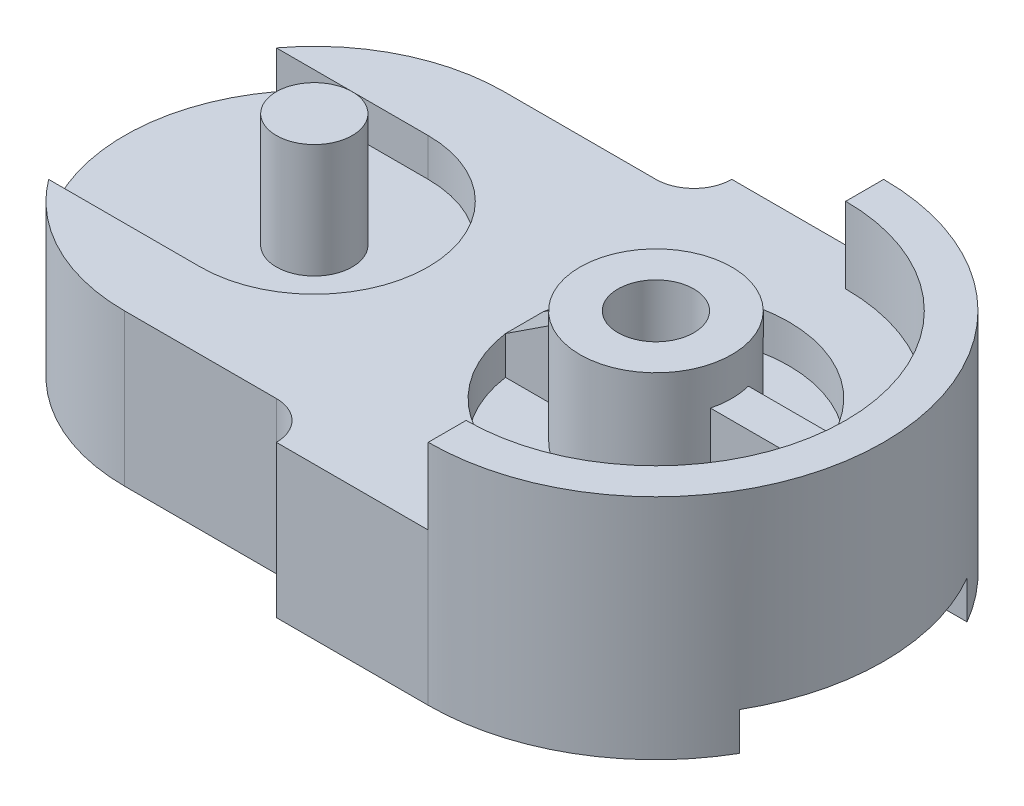
ISO-10303-21;
HEADER;
FILE_DESCRIPTION(('STEP AP214'),'2;1');
FILE_NAME('part.step','',(''),(''),'','','');
FILE_SCHEMA(('AUTOMOTIVE_DESIGN { 1 0 10303 214 1 1 1 1 }'));
ENDSEC;
DATA;
#1=APPLICATION_CONTEXT('core data for automotive mechanical design processes');
#2=APPLICATION_PROTOCOL_DEFINITION('international standard','automotive_design',2000,#1);
#3=PRODUCT_CONTEXT('',#1,'mechanical');
#4=PRODUCT('Part','Part','',(#3));
#5=PRODUCT_RELATED_PRODUCT_CATEGORY('part','',(#4));
#6=PRODUCT_DEFINITION_FORMATION('','',#4);
#7=PRODUCT_DEFINITION_CONTEXT('part definition',#1,'design');
#8=PRODUCT_DEFINITION('design','',#6,#7);
#9=PRODUCT_DEFINITION_SHAPE('','',#8);
#10=(LENGTH_UNIT() NAMED_UNIT(*) SI_UNIT(.MILLI.,.METRE.));
#11=(NAMED_UNIT(*) PLANE_ANGLE_UNIT() SI_UNIT($,.RADIAN.));
#12=(NAMED_UNIT(*) SI_UNIT($,.STERADIAN.) SOLID_ANGLE_UNIT());
#13=UNCERTAINTY_MEASURE_WITH_UNIT(LENGTH_MEASURE(1.E-05),#10,'distance_accuracy_value','');
#14=(GEOMETRIC_REPRESENTATION_CONTEXT(3) GLOBAL_UNCERTAINTY_ASSIGNED_CONTEXT((#13)) GLOBAL_UNIT_ASSIGNED_CONTEXT((#10,
#11,#12)) REPRESENTATION_CONTEXT('',''));
#15=CARTESIAN_POINT('',(0.,0.,0.));
#16=DIRECTION('',(0.,0.,1.));
#17=DIRECTION('',(1.,0.,0.));
#18=AXIS2_PLACEMENT_3D('',#15,#16,#17);
#19=CARTESIAN_POINT('',(140.,60.,-60.));
#20=DIRECTION('',(0.,-1.,0.));
#21=DIRECTION('',(0.,0.,-1.));
#22=AXIS2_PLACEMENT_3D('',#19,#20,#21);
#23=CYLINDRICAL_SURFACE('',#22,20.);
#24=CARTESIAN_POINT('',(140.,60.,-60.));
#25=DIRECTION('',(0.,1.,0.));
#26=DIRECTION('',(0.,0.,1.));
#27=AXIS2_PLACEMENT_3D('',#24,#25,#26);
#28=CIRCLE('',#27,20.);
#29=CARTESIAN_POINT('',(140.,60.,-40.));
#30=VERTEX_POINT('',#29);
#31=EDGE_CURVE('E304',#30,#30,#28,.T.);
#32=ORIENTED_EDGE('',*,*,#31,.F.);
#33=EDGE_LOOP('',(#32));
#34=FACE_BOUND('',#33,.T.);
#35=DIRECTION('',(0.,-1.,0.));
#36=VECTOR('',#35,1.);
#37=CARTESIAN_POINT('',(120.635083268963,50.,-65.));
#38=LINE('',#37,#36);
#39=CARTESIAN_POINT('',(120.635083268963,50.,-65.));
#40=VERTEX_POINT('',#39);
#41=CARTESIAN_POINT('',(120.635083268963,30.,-65.));
#42=VERTEX_POINT('',#41);
#43=EDGE_CURVE('E260',#40,#42,#38,.T.);
#44=ORIENTED_EDGE('',*,*,#43,.F.);
#45=CARTESIAN_POINT('',(140.,50.,-60.));
#46=DIRECTION('',(0.,1.,0.));
#47=DIRECTION('',(0.,0.,1.));
#48=AXIS2_PLACEMENT_3D('',#45,#46,#47);
#49=CIRCLE('',#48,20.);
#50=CARTESIAN_POINT('',(120.635083268963,50.,-55.));
#51=VERTEX_POINT('',#50);
#52=EDGE_CURVE('E11',#40,#51,#49,.T.);
#53=ORIENTED_EDGE('',*,*,#52,.T.);
#54=DIRECTION('',(0.,-1.,0.));
#55=VECTOR('',#54,1.);
#56=CARTESIAN_POINT('',(120.635083268963,50.,-55.));
#57=LINE('',#56,#55);
#58=CARTESIAN_POINT('',(120.635083268963,30.,-55.));
#59=VERTEX_POINT('',#58);
#60=EDGE_CURVE('E266',#51,#59,#57,.T.);
#61=ORIENTED_EDGE('',*,*,#60,.T.);
#62=CARTESIAN_POINT('',(140.,30.,-60.));
#63=DIRECTION('',(0.,1.,0.));
#64=DIRECTION('',(0.,0.,1.));
#65=AXIS2_PLACEMENT_3D('',#62,#63,#64);
#66=CIRCLE('',#65,20.);
#67=CARTESIAN_POINT('',(159.364916731037,30.,-55.));
#68=VERTEX_POINT('',#67);
#69=EDGE_CURVE('E296',#59,#68,#66,.T.);
#70=ORIENTED_EDGE('',*,*,#69,.T.);
#71=DIRECTION('',(0.,-1.,0.));
#72=VECTOR('',#71,1.);
#73=CARTESIAN_POINT('',(159.364916731037,60.,-55.));
#74=LINE('',#73,#72);
#75=CARTESIAN_POINT('',(159.364916731037,50.,-55.));
#76=VERTEX_POINT('',#75);
#77=EDGE_CURVE('E285',#76,#68,#74,.T.);
#78=ORIENTED_EDGE('',*,*,#77,.F.);
#79=CARTESIAN_POINT('',(140.,50.,-60.));
#80=DIRECTION('',(0.,1.,0.));
#81=DIRECTION('',(0.,0.,1.));
#82=AXIS2_PLACEMENT_3D('',#79,#80,#81);
#83=CIRCLE('',#82,20.);
#84=CARTESIAN_POINT('',(159.364916731037,50.,-65.));
#85=VERTEX_POINT('',#84);
#86=EDGE_CURVE('E43',#76,#85,#83,.T.);
#87=ORIENTED_EDGE('',*,*,#86,.T.);
#88=DIRECTION('',(0.,-1.,0.));
#89=VECTOR('',#88,1.);
#90=CARTESIAN_POINT('',(159.364916731037,60.,-65.));
#91=LINE('',#90,#89);
#92=CARTESIAN_POINT('',(159.364916731037,30.,-65.));
#93=VERTEX_POINT('',#92);
#94=EDGE_CURVE('E291',#85,#93,#91,.T.);
#95=ORIENTED_EDGE('',*,*,#94,.T.);
#96=EDGE_CURVE('E297',#93,#42,#66,.T.);
#97=ORIENTED_EDGE('',*,*,#96,.T.);
#98=EDGE_LOOP('',(#44,#53,#61,#70,#78,#87,#95,#97));
#99=FACE_BOUND('',#98,.T.);
#100=ADVANCED_FACE('F35',(#34,#99),#23,.T.);
#101=CARTESIAN_POINT('',(140.,30.,-60.));
#102=DIRECTION('',(0.,1.,0.));
#103=DIRECTION('',(0.,0.,1.));
#104=AXIS2_PLACEMENT_3D('',#101,#102,#103);
#105=CYLINDRICAL_SURFACE('',#104,35.);
#106=DIRECTION('',(0.,-1.,0.));
#107=VECTOR('',#106,1.);
#108=CARTESIAN_POINT('',(105.358983848622,50.,-65.));
#109=LINE('',#108,#107);
#110=CARTESIAN_POINT('',(105.358983848622,40.,-65.));
#111=VERTEX_POINT('',#110);
#112=CARTESIAN_POINT('',(105.358983848622,30.,-65.));
#113=VERTEX_POINT('',#112);
#114=EDGE_CURVE('E255',#111,#113,#109,.T.);
#115=ORIENTED_EDGE('',*,*,#114,.T.);
#116=CARTESIAN_POINT('',(140.,30.,-60.));
#117=DIRECTION('',(0.,1.,0.));
#118=DIRECTION('',(0.,0.,1.));
#119=AXIS2_PLACEMENT_3D('',#116,#117,#118);
#120=CIRCLE('',#119,35.);
#121=CARTESIAN_POINT('',(174.641016151378,30.,-65.));
#122=VERTEX_POINT('',#121);
#123=EDGE_CURVE('E299',#122,#113,#120,.T.);
#124=ORIENTED_EDGE('',*,*,#123,.F.);
#125=DIRECTION('',(0.,1.,0.));
#126=VECTOR('',#125,1.);
#127=CARTESIAN_POINT('',(174.641016151378,30.,-65.));
#128=LINE('',#127,#126);
#129=CARTESIAN_POINT('',(174.641016151378,40.,-65.));
#130=VERTEX_POINT('',#129);
#131=EDGE_CURVE('E256',#122,#130,#128,.T.);
#132=ORIENTED_EDGE('',*,*,#131,.T.);
#133=CARTESIAN_POINT('',(140.,40.,-60.));
#134=DIRECTION('',(0.,1.,0.));
#135=DIRECTION('',(0.,0.,1.));
#136=AXIS2_PLACEMENT_3D('',#133,#134,#135);
#137=CIRCLE('',#136,35.);
#138=EDGE_CURVE('E233',#130,#111,#137,.T.);
#139=ORIENTED_EDGE('',*,*,#138,.T.);
#140=EDGE_LOOP('',(#115,#124,#132,#139));
#141=FACE_BOUND('',#140,.T.);
#142=ADVANCED_FACE('F253',(#141),#105,.F.);
#143=CARTESIAN_POINT('',(140.,30.,-60.));
#144=DIRECTION('',(0.,1.,0.));
#145=DIRECTION('',(0.,0.,1.));
#146=AXIS2_PLACEMENT_3D('',#143,#144,#145);
#147=PLANE('',#146);
#148=ORIENTED_EDGE('',*,*,#123,.T.);
#149=DIRECTION('',(-1.,0.,0.));
#150=VECTOR('',#149,1.);
#151=CARTESIAN_POINT('',(0.,30.,-65.));
#152=LINE('',#151,#150);
#153=EDGE_CURVE('E50',#42,#113,#152,.T.);
#154=ORIENTED_EDGE('',*,*,#153,.F.);
#155=ORIENTED_EDGE('',*,*,#96,.F.);
#156=DIRECTION('',(-1.,0.,0.));
#157=VECTOR('',#156,1.);
#158=CARTESIAN_POINT('',(140.,30.,-65.));
#159=LINE('',#158,#157);
#160=EDGE_CURVE('E468',#122,#93,#159,.T.);
#161=ORIENTED_EDGE('',*,*,#160,.F.);
#162=EDGE_LOOP('',(#148,#154,#155,#161));
#163=FACE_BOUND('',#162,.T.);
#164=ADVANCED_FACE('F580',(#163),#147,.T.);
#165=CARTESIAN_POINT('',(0.,40.,0.));
#166=DIRECTION('',(0.,-1.,0.));
#167=DIRECTION('',(0.,0.,-1.));
#168=AXIS2_PLACEMENT_3D('',#165,#166,#167);
#169=PLANE('',#168);
#170=DIRECTION('',(0.,0.,1.));
#171=VECTOR('',#170,1.);
#172=CARTESIAN_POINT('',(105.358983848622,40.,-75.));
#173=LINE('',#172,#171);
#174=CARTESIAN_POINT('',(105.358983848622,40.,-55.));
#175=VERTEX_POINT('',#174);
#176=EDGE_CURVE('E228',#111,#175,#173,.T.);
#177=ORIENTED_EDGE('',*,*,#176,.F.);
#178=ORIENTED_EDGE('',*,*,#138,.F.);
#179=DIRECTION('',(1.,0.,0.));
#180=VECTOR('',#179,1.);
#181=CARTESIAN_POINT('',(0.,40.,-65.));
#182=LINE('',#181,#180);
#183=CARTESIAN_POINT('',(189.749371855331,40.,-65.));
#184=VERTEX_POINT('',#183);
#185=EDGE_CURVE('E294',#130,#184,#182,.T.);
#186=ORIENTED_EDGE('',*,*,#185,.T.);
#187=CARTESIAN_POINT('',(140.,40.,-60.));
#188=DIRECTION('',(0.,-1.,0.));
#189=DIRECTION('',(0.,0.,-1.));
#190=AXIS2_PLACEMENT_3D('',#187,#188,#189);
#191=CIRCLE('',#190,50.);
#192=CARTESIAN_POINT('',(140.,40.,-110.));
#193=VERTEX_POINT('',#192);
#194=EDGE_CURVE('E356',#193,#184,#191,.T.);
#195=ORIENTED_EDGE('',*,*,#194,.F.);
#196=DIRECTION('',(0.,0.,1.));
#197=VECTOR('',#196,1.);
#198=CARTESIAN_POINT('',(140.,40.,-110.));
#199=LINE('',#198,#197);
#200=CARTESIAN_POINT('',(140.,40.,-120.));
#201=VERTEX_POINT('',#200);
#202=EDGE_CURVE('E335',#201,#193,#199,.T.);
#203=ORIENTED_EDGE('',*,*,#202,.F.);
#204=DIRECTION('',(-1.,0.,0.));
#205=VECTOR('',#204,1.);
#206=CARTESIAN_POINT('',(0.,40.,-120.));
#207=LINE('',#206,#205);
#208=CARTESIAN_POINT('',(100.,40.,-120.));
#209=VERTEX_POINT('',#208);
#210=EDGE_CURVE('E447',#201,#209,#207,.T.);
#211=ORIENTED_EDGE('',*,*,#210,.T.);
#212=CARTESIAN_POINT('',(90.,40.,-120.));
#213=DIRECTION('',(0.,1.,0.));
#214=DIRECTION('',(0.,0.,1.));
#215=AXIS2_PLACEMENT_3D('',#212,#213,#214);
#216=CIRCLE('',#215,9.99999999999999);
#217=CARTESIAN_POINT('',(90.,40.,-110.));
#218=VERTEX_POINT('',#217);
#219=EDGE_CURVE('E404',#218,#209,#216,.T.);
#220=ORIENTED_EDGE('',*,*,#219,.F.);
#221=DIRECTION('',(1.,0.,0.));
#222=VECTOR('',#221,1.);
#223=CARTESIAN_POINT('',(0.,40.,-110.));
#224=LINE('',#223,#222);
#225=CARTESIAN_POINT('',(50.,40.,-110.));
#226=VERTEX_POINT('',#225);
#227=EDGE_CURVE('E425',#226,#218,#224,.T.);
#228=ORIENTED_EDGE('',*,*,#227,.F.);
#229=CARTESIAN_POINT('',(50.,40.,-60.));
#230=DIRECTION('',(0.,1.,0.));
#231=DIRECTION('',(0.,0.,1.));
#232=AXIS2_PLACEMENT_3D('',#229,#230,#231);
#233=CIRCLE('',#232,50.);
#234=CARTESIAN_POINT('',(10.,40.,-90.));
#235=VERTEX_POINT('',#234);
#236=EDGE_CURVE('E430',#226,#235,#233,.T.);
#237=ORIENTED_EDGE('',*,*,#236,.T.);
#238=DIRECTION('',(1.,0.,0.));
#239=VECTOR('',#238,1.);
#240=CARTESIAN_POINT('',(0.,40.,-90.));
#241=LINE('',#240,#239);
#242=CARTESIAN_POINT('',(50.,40.,-90.));
#243=VERTEX_POINT('',#242);
#244=EDGE_CURVE('E328',#235,#243,#241,.T.);
#245=ORIENTED_EDGE('',*,*,#244,.T.);
#246=CARTESIAN_POINT('',(50.,40.,-60.));
#247=DIRECTION('',(0.,1.,0.));
#248=DIRECTION('',(0.,0.,1.));
#249=AXIS2_PLACEMENT_3D('',#246,#247,#248);
#250=CIRCLE('',#249,30.);
#251=CARTESIAN_POINT('',(50.,40.,-30.));
#252=VERTEX_POINT('',#251);
#253=EDGE_CURVE('E311',#243,#252,#250,.F.);
#254=ORIENTED_EDGE('',*,*,#253,.T.);
#255=DIRECTION('',(1.,0.,0.));
#256=VECTOR('',#255,1.);
#257=CARTESIAN_POINT('',(0.,40.,-30.));
#258=LINE('',#257,#256);
#259=CARTESIAN_POINT('',(10.,40.,-30.));
#260=VERTEX_POINT('',#259);
#261=EDGE_CURVE('E318',#260,#252,#258,.T.);
#262=ORIENTED_EDGE('',*,*,#261,.F.);
#263=CARTESIAN_POINT('',(50.,40.,-9.99999999999999));
#264=VERTEX_POINT('',#263);
#265=EDGE_CURVE('E437',#260,#264,#233,.T.);
#266=ORIENTED_EDGE('',*,*,#265,.T.);
#267=DIRECTION('',(1.,0.,0.));
#268=VECTOR('',#267,1.);
#269=CARTESIAN_POINT('',(0.,40.,-9.99999999999999));
#270=LINE('',#269,#268);
#271=CARTESIAN_POINT('',(90.,40.,-9.99999999999999));
#272=VERTEX_POINT('',#271);
#273=EDGE_CURVE('E413',#264,#272,#270,.T.);
#274=ORIENTED_EDGE('',*,*,#273,.T.);
#275=CARTESIAN_POINT('',(90.,40.,0.));
#276=DIRECTION('',(0.,1.,0.));
#277=DIRECTION('',(0.,0.,-1.));
#278=AXIS2_PLACEMENT_3D('',#275,#276,#277);
#279=CIRCLE('',#278,9.99999999999999);
#280=CARTESIAN_POINT('',(100.,40.,0.));
#281=VERTEX_POINT('',#280);
#282=EDGE_CURVE('E394',#281,#272,#279,.T.);
#283=ORIENTED_EDGE('',*,*,#282,.F.);
#284=DIRECTION('',(1.,0.,0.));
#285=VECTOR('',#284,1.);
#286=CARTESIAN_POINT('',(0.,40.,0.));
#287=LINE('',#286,#285);
#288=CARTESIAN_POINT('',(140.,40.,0.));
#289=VERTEX_POINT('',#288);
#290=EDGE_CURVE('E444',#281,#289,#287,.T.);
#291=ORIENTED_EDGE('',*,*,#290,.T.);
#292=DIRECTION('',(0.,0.,1.));
#293=VECTOR('',#292,1.);
#294=CARTESIAN_POINT('',(140.,40.,-9.99999999999999));
#295=LINE('',#294,#293);
#296=CARTESIAN_POINT('',(140.,40.,-9.99999999999999));
#297=VERTEX_POINT('',#296);
#298=EDGE_CURVE('E346',#297,#289,#295,.T.);
#299=ORIENTED_EDGE('',*,*,#298,.F.);
#300=CARTESIAN_POINT('',(189.749371855331,40.,-55.));
#301=VERTEX_POINT('',#300);
#302=EDGE_CURVE('E355',#301,#297,#191,.T.);
#303=ORIENTED_EDGE('',*,*,#302,.F.);
#304=DIRECTION('',(1.,0.,0.));
#305=VECTOR('',#304,1.);
#306=CARTESIAN_POINT('',(0.,40.,-55.0000000000001));
#307=LINE('',#306,#305);
#308=CARTESIAN_POINT('',(174.641016151378,40.,-55.));
#309=VERTEX_POINT('',#308);
#310=EDGE_CURVE('E288',#309,#301,#307,.T.);
#311=ORIENTED_EDGE('',*,*,#310,.F.);
#312=EDGE_CURVE('E235',#175,#309,#137,.T.);
#313=ORIENTED_EDGE('',*,*,#312,.F.);
#314=EDGE_LOOP('',(#177,#178,#186,#195,#203,#211,#220,#228,#237,#245,#254,#262,#266,#274,#283,
#291,#299,#303,#311,#313));
#315=FACE_BOUND('',#314,.T.);
#316=ADVANCED_FACE('F230',(#315),#169,.F.);
#317=CARTESIAN_POINT('',(0.,30.,0.));
#318=DIRECTION('',(0.,1.,0.));
#319=DIRECTION('',(0.,0.,1.));
#320=AXIS2_PLACEMENT_3D('',#317,#318,#319);
#321=PLANE('',#320);
#322=CARTESIAN_POINT('',(50.,30.,-60.));
#323=DIRECTION('',(0.,1.,0.));
#324=DIRECTION('',(0.,0.,1.));
#325=AXIS2_PLACEMENT_3D('',#322,#323,#324);
#326=CIRCLE('',#325,30.);
#327=CARTESIAN_POINT('',(50.,30.,-90.));
#328=VERTEX_POINT('',#327);
#329=CARTESIAN_POINT('',(50.,30.,-30.));
#330=VERTEX_POINT('',#329);
#331=EDGE_CURVE('E315',#328,#330,#326,.F.);
#332=ORIENTED_EDGE('',*,*,#331,.F.);
#333=DIRECTION('',(1.,0.,0.));
#334=VECTOR('',#333,1.);
#335=CARTESIAN_POINT('',(0.,30.,-90.));
#336=LINE('',#335,#334);
#337=CARTESIAN_POINT('',(10.,30.,-90.));
#338=VERTEX_POINT('',#337);
#339=EDGE_CURVE('E317',#338,#328,#336,.T.);
#340=ORIENTED_EDGE('',*,*,#339,.F.);
#341=CARTESIAN_POINT('',(50.,30.,-60.));
#342=DIRECTION('',(0.,1.,0.));
#343=DIRECTION('',(0.,0.,1.));
#344=AXIS2_PLACEMENT_3D('',#341,#342,#343);
#345=CIRCLE('',#344,50.);
#346=CARTESIAN_POINT('',(10.,30.,-30.));
#347=VERTEX_POINT('',#346);
#348=EDGE_CURVE('E320',#338,#347,#345,.T.);
#349=ORIENTED_EDGE('',*,*,#348,.T.);
#350=DIRECTION('',(1.,0.,0.));
#351=VECTOR('',#350,1.);
#352=CARTESIAN_POINT('',(0.,30.,-30.));
#353=LINE('',#352,#351);
#354=EDGE_CURVE('E322',#347,#330,#353,.T.);
#355=ORIENTED_EDGE('',*,*,#354,.T.);
#356=EDGE_LOOP('',(#332,#340,#349,#355));
#357=FACE_BOUND('',#356,.T.);
#358=CARTESIAN_POINT('',(50.,30.,-60.));
#359=DIRECTION('',(0.,1.,0.));
#360=DIRECTION('',(0.,0.,1.));
#361=AXIS2_PLACEMENT_3D('',#358,#359,#360);
#362=CIRCLE('',#361,10.);
#363=CARTESIAN_POINT('',(50.,30.,-50.));
#364=VERTEX_POINT('',#363);
#365=EDGE_CURVE('E312',#364,#364,#362,.T.);
#366=ORIENTED_EDGE('',*,*,#365,.F.);
#367=EDGE_LOOP('',(#366));
#368=FACE_BOUND('',#367,.T.);
#369=ADVANCED_FACE('F598',(#357,#368),#321,.T.);
#370=CARTESIAN_POINT('',(0.,40.,0.));
#371=DIRECTION('',(0.,0.,-1.));
#372=DIRECTION('',(-1.,0.,0.));
#373=AXIS2_PLACEMENT_3D('',#370,#371,#372);
#374=PLANE('',#373);
#375=DIRECTION('',(0.,1.,0.));
#376=VECTOR('',#375,1.);
#377=CARTESIAN_POINT('',(140.,-76.,0.));
#378=LINE('',#377,#376);
#379=CARTESIAN_POINT('',(140.,0.,0.));
#380=VERTEX_POINT('',#379);
#381=EDGE_CURVE('E380',#380,#289,#378,.T.);
#382=ORIENTED_EDGE('',*,*,#381,.T.);
#383=ORIENTED_EDGE('',*,*,#290,.F.);
#384=DIRECTION('',(0.,1.,0.));
#385=VECTOR('',#384,1.);
#386=CARTESIAN_POINT('',(100.,0.,0.));
#387=LINE('',#386,#385);
#388=CARTESIAN_POINT('',(100.,0.,0.));
#389=VERTEX_POINT('',#388);
#390=EDGE_CURVE('E401',#389,#281,#387,.T.);
#391=ORIENTED_EDGE('',*,*,#390,.F.);
#392=DIRECTION('',(1.,0.,0.));
#393=VECTOR('',#392,1.);
#394=CARTESIAN_POINT('',(0.,0.,0.));
#395=LINE('',#394,#393);
#396=EDGE_CURVE('E442',#389,#380,#395,.T.);
#397=ORIENTED_EDGE('',*,*,#396,.T.);
#398=EDGE_LOOP('',(#382,#383,#391,#397));
#399=FACE_BOUND('',#398,.T.);
#400=ADVANCED_FACE('F37',(#399),#374,.F.);
#401=CARTESIAN_POINT('',(0.,0.,0.));
#402=DIRECTION('',(0.,-1.,0.));
#403=DIRECTION('',(0.,0.,-1.));
#404=AXIS2_PLACEMENT_3D('',#401,#402,#403);
#405=PLANE('',#404);
#406=CARTESIAN_POINT('',(140.,0.,-60.));
#407=DIRECTION('',(0.,-1.,0.));
#408=DIRECTION('',(0.,0.,-1.));
#409=AXIS2_PLACEMENT_3D('',#406,#407,#408);
#410=CIRCLE('',#409,60.);
#411=CARTESIAN_POINT('',(191.961524227066,0.,-90.));
#412=VERTEX_POINT('',#411);
#413=CARTESIAN_POINT('',(140.,0.,-120.));
#414=VERTEX_POINT('',#413);
#415=EDGE_CURVE('E378',#412,#414,#410,.F.);
#416=ORIENTED_EDGE('',*,*,#415,.F.);
#417=DIRECTION('',(1.,0.,0.));
#418=VECTOR('',#417,1.);
#419=CARTESIAN_POINT('',(200.,0.,-90.));
#420=LINE('',#419,#418);
#421=CARTESIAN_POINT('',(10.,0.,-90.));
#422=VERTEX_POINT('',#421);
#423=EDGE_CURVE('E391',#422,#412,#420,.T.);
#424=ORIENTED_EDGE('',*,*,#423,.F.);
#425=CARTESIAN_POINT('',(50.,0.,-60.));
#426=DIRECTION('',(0.,1.,0.));
#427=DIRECTION('',(0.,0.,1.));
#428=AXIS2_PLACEMENT_3D('',#425,#426,#427);
#429=CIRCLE('',#428,50.);
#430=CARTESIAN_POINT('',(50.,0.,-110.));
#431=VERTEX_POINT('',#430);
#432=EDGE_CURVE('E431',#431,#422,#429,.T.);
#433=ORIENTED_EDGE('',*,*,#432,.F.);
#434=DIRECTION('',(1.,0.,0.));
#435=VECTOR('',#434,1.);
#436=CARTESIAN_POINT('',(0.,0.,-110.));
#437=LINE('',#436,#435);
#438=CARTESIAN_POINT('',(90.,0.,-110.));
#439=VERTEX_POINT('',#438);
#440=EDGE_CURVE('E426',#431,#439,#437,.T.);
#441=ORIENTED_EDGE('',*,*,#440,.T.);
#442=CARTESIAN_POINT('',(90.,0.,-120.));
#443=DIRECTION('',(0.,1.,0.));
#444=DIRECTION('',(0.,0.,1.));
#445=AXIS2_PLACEMENT_3D('',#442,#443,#444);
#446=CIRCLE('',#445,9.99999999999999);
#447=CARTESIAN_POINT('',(100.,0.,-120.));
#448=VERTEX_POINT('',#447);
#449=EDGE_CURVE('E405',#439,#448,#446,.T.);
#450=ORIENTED_EDGE('',*,*,#449,.T.);
#451=DIRECTION('',(-1.,0.,0.));
#452=VECTOR('',#451,1.);
#453=CARTESIAN_POINT('',(0.,0.,-120.));
#454=LINE('',#453,#452);
#455=EDGE_CURVE('E448',#414,#448,#454,.T.);
#456=ORIENTED_EDGE('',*,*,#455,.F.);
#457=EDGE_LOOP('',(#416,#424,#433,#441,#450,#456));
#458=FACE_BOUND('',#457,.T.);
#459=ADVANCED_FACE('F514',(#458),#405,.T.);
#460=CARTESIAN_POINT('',(140.,0.,-60.));
#461=DIRECTION('',(0.,-1.,0.));
#462=DIRECTION('',(0.,0.,-1.));
#463=AXIS2_PLACEMENT_3D('',#460,#461,#462);
#464=CIRCLE('',#463,60.);
#465=CARTESIAN_POINT('',(191.961524227066,0.,-30.));
#466=VERTEX_POINT('',#465);
#467=EDGE_CURVE('E385',#380,#466,#464,.F.);
#468=ORIENTED_EDGE('',*,*,#467,.F.);
#469=ORIENTED_EDGE('',*,*,#396,.F.);
#470=CARTESIAN_POINT('',(90.,0.,0.));
#471=DIRECTION('',(0.,1.,0.));
#472=DIRECTION('',(0.,0.,-1.));
#473=AXIS2_PLACEMENT_3D('',#470,#471,#472);
#474=CIRCLE('',#473,9.99999999999999);
#475=CARTESIAN_POINT('',(90.,0.,-9.99999999999999));
#476=VERTEX_POINT('',#475);
#477=EDGE_CURVE('E398',#389,#476,#474,.T.);
#478=ORIENTED_EDGE('',*,*,#477,.T.);
#479=DIRECTION('',(1.,0.,0.));
#480=VECTOR('',#479,1.);
#481=CARTESIAN_POINT('',(0.,0.,-9.99999999999999));
#482=LINE('',#481,#480);
#483=CARTESIAN_POINT('',(50.,0.,-9.99999999999999));
#484=VERTEX_POINT('',#483);
#485=EDGE_CURVE('E417',#484,#476,#482,.T.);
#486=ORIENTED_EDGE('',*,*,#485,.F.);
#487=CARTESIAN_POINT('',(9.99999999999999,0.,-30.));
#488=VERTEX_POINT('',#487);
#489=EDGE_CURVE('E429',#488,#484,#429,.T.);
#490=ORIENTED_EDGE('',*,*,#489,.F.);
#491=DIRECTION('',(-1.,0.,0.));
#492=VECTOR('',#491,1.);
#493=CARTESIAN_POINT('',(200.,0.,-30.));
#494=LINE('',#493,#492);
#495=EDGE_CURVE('E387',#466,#488,#494,.T.);
#496=ORIENTED_EDGE('',*,*,#495,.F.);
#497=EDGE_LOOP('',(#468,#469,#478,#486,#490,#496));
#498=FACE_BOUND('',#497,.T.);
#499=ADVANCED_FACE('F547',(#498),#405,.T.);
#500=CARTESIAN_POINT('',(0.,40.,-120.));
#501=DIRECTION('',(0.,0.,1.));
#502=DIRECTION('',(1.,0.,0.));
#503=AXIS2_PLACEMENT_3D('',#500,#501,#502);
#504=PLANE('',#503);
#505=ORIENTED_EDGE('',*,*,#210,.F.);
#506=DIRECTION('',(0.,1.,0.));
#507=VECTOR('',#506,1.);
#508=CARTESIAN_POINT('',(140.,-76.,-120.));
#509=LINE('',#508,#507);
#510=EDGE_CURVE('E372',#414,#201,#509,.T.);
#511=ORIENTED_EDGE('',*,*,#510,.F.);
#512=ORIENTED_EDGE('',*,*,#455,.T.);
#513=DIRECTION('',(0.,1.,0.));
#514=VECTOR('',#513,1.);
#515=CARTESIAN_POINT('',(100.,0.,-120.));
#516=LINE('',#515,#514);
#517=EDGE_CURVE('E408',#448,#209,#516,.T.);
#518=ORIENTED_EDGE('',*,*,#517,.T.);
#519=EDGE_LOOP('',(#505,#511,#512,#518));
#520=FACE_BOUND('',#519,.T.);
#521=ADVANCED_FACE('F508',(#520),#504,.F.);
#522=CARTESIAN_POINT('',(0.,0.,-110.));
#523=DIRECTION('',(0.,0.,1.));
#524=DIRECTION('',(1.,0.,0.));
#525=AXIS2_PLACEMENT_3D('',#522,#523,#524);
#526=PLANE('',#525);
#527=ORIENTED_EDGE('',*,*,#227,.T.);
#528=DIRECTION('',(0.,1.,0.));
#529=VECTOR('',#528,1.);
#530=CARTESIAN_POINT('',(90.,0.,-110.));
#531=LINE('',#530,#529);
#532=EDGE_CURVE('E434',#439,#218,#531,.T.);
#533=ORIENTED_EDGE('',*,*,#532,.F.);
#534=ORIENTED_EDGE('',*,*,#440,.F.);
#535=DIRECTION('',(0.,1.,0.));
#536=VECTOR('',#535,1.);
#537=CARTESIAN_POINT('',(50.,0.,-110.));
#538=LINE('',#537,#536);
#539=EDGE_CURVE('E440',#431,#226,#538,.T.);
#540=ORIENTED_EDGE('',*,*,#539,.T.);
#541=EDGE_LOOP('',(#527,#533,#534,#540));
#542=FACE_BOUND('',#541,.T.);
#543=ADVANCED_FACE('F519',(#542),#526,.F.);
#544=CARTESIAN_POINT('',(50.,0.,-60.));
#545=DIRECTION('',(0.,1.,0.));
#546=DIRECTION('',(0.,0.,1.));
#547=AXIS2_PLACEMENT_3D('',#544,#545,#546);
#548=CYLINDRICAL_SURFACE('',#547,50.);
#549=DIRECTION('',(0.,1.,0.));
#550=VECTOR('',#549,1.);
#551=CARTESIAN_POINT('',(10.,30.,-30.));
#552=LINE('',#551,#550);
#553=EDGE_CURVE('E336',#347,#260,#552,.T.);
#554=ORIENTED_EDGE('',*,*,#553,.F.);
#555=ORIENTED_EDGE('',*,*,#348,.F.);
#556=DIRECTION('',(0.,1.,0.));
#557=VECTOR('',#556,1.);
#558=CARTESIAN_POINT('',(10.,30.,-90.));
#559=LINE('',#558,#557);
#560=EDGE_CURVE('E338',#338,#235,#559,.T.);
#561=ORIENTED_EDGE('',*,*,#560,.T.);
#562=ORIENTED_EDGE('',*,*,#236,.F.);
#563=ORIENTED_EDGE('',*,*,#539,.F.);
#564=ORIENTED_EDGE('',*,*,#432,.T.);
#565=DIRECTION('',(0.,1.,0.));
#566=VECTOR('',#565,1.);
#567=CARTESIAN_POINT('',(10.,0.,-90.));
#568=LINE('',#567,#566);
#569=CARTESIAN_POINT('',(10.,10.,-90.));
#570=VERTEX_POINT('',#569);
#571=EDGE_CURVE('E458',#570,#422,#568,.F.);
#572=ORIENTED_EDGE('',*,*,#571,.F.);
#573=CARTESIAN_POINT('',(50.,10.,-60.));
#574=DIRECTION('',(0.,1.,0.));
#575=DIRECTION('',(0.,0.,1.));
#576=AXIS2_PLACEMENT_3D('',#573,#574,#575);
#577=CIRCLE('',#576,50.);
#578=CARTESIAN_POINT('',(9.99999999999999,10.,-30.));
#579=VERTEX_POINT('',#578);
#580=EDGE_CURVE('E450',#579,#570,#577,.F.);
#581=ORIENTED_EDGE('',*,*,#580,.F.);
#582=DIRECTION('',(0.,1.,0.));
#583=VECTOR('',#582,1.);
#584=CARTESIAN_POINT('',(9.99999999999999,0.,-30.));
#585=LINE('',#584,#583);
#586=EDGE_CURVE('E455',#488,#579,#585,.T.);
#587=ORIENTED_EDGE('',*,*,#586,.F.);
#588=ORIENTED_EDGE('',*,*,#489,.T.);
#589=DIRECTION('',(0.,1.,0.));
#590=VECTOR('',#589,1.);
#591=CARTESIAN_POINT('',(50.,0.,-9.99999999999999));
#592=LINE('',#591,#590);
#593=EDGE_CURVE('E418',#484,#264,#592,.T.);
#594=ORIENTED_EDGE('',*,*,#593,.T.);
#595=ORIENTED_EDGE('',*,*,#265,.F.);
#596=EDGE_LOOP('',(#554,#555,#561,#562,#563,#564,#572,#581,#587,#588,#594,#595));
#597=FACE_BOUND('',#596,.T.);
#598=ADVANCED_FACE('F524',(#597),#548,.T.);
#599=CARTESIAN_POINT('',(0.,0.,-9.99999999999999));
#600=DIRECTION('',(0.,0.,1.));
#601=DIRECTION('',(1.,0.,0.));
#602=AXIS2_PLACEMENT_3D('',#599,#600,#601);
#603=PLANE('',#602);
#604=ORIENTED_EDGE('',*,*,#273,.F.);
#605=ORIENTED_EDGE('',*,*,#593,.F.);
#606=ORIENTED_EDGE('',*,*,#485,.T.);
#607=DIRECTION('',(0.,1.,0.));
#608=VECTOR('',#607,1.);
#609=CARTESIAN_POINT('',(90.,0.,-9.99999999999999));
#610=LINE('',#609,#608);
#611=EDGE_CURVE('E414',#476,#272,#610,.T.);
#612=ORIENTED_EDGE('',*,*,#611,.T.);
#613=EDGE_LOOP('',(#604,#605,#606,#612));
#614=FACE_BOUND('',#613,.T.);
#615=ADVANCED_FACE('F544',(#614),#603,.T.);
#616=CARTESIAN_POINT('',(90.,0.,-120.));
#617=DIRECTION('',(0.,1.,0.));
#618=DIRECTION('',(0.,0.,1.));
#619=AXIS2_PLACEMENT_3D('',#616,#617,#618);
#620=CYLINDRICAL_SURFACE('',#619,9.99999999999999);
#621=ORIENTED_EDGE('',*,*,#219,.T.);
#622=ORIENTED_EDGE('',*,*,#517,.F.);
#623=ORIENTED_EDGE('',*,*,#449,.F.);
#624=ORIENTED_EDGE('',*,*,#532,.T.);
#625=EDGE_LOOP('',(#621,#622,#623,#624));
#626=FACE_BOUND('',#625,.T.);
#627=ADVANCED_FACE('F511',(#626),#620,.F.);
#628=CARTESIAN_POINT('',(90.,0.,0.));
#629=DIRECTION('',(0.,1.,0.));
#630=DIRECTION('',(0.,0.,1.));
#631=AXIS2_PLACEMENT_3D('',#628,#629,#630);
#632=CYLINDRICAL_SURFACE('',#631,9.99999999999999);
#633=ORIENTED_EDGE('',*,*,#282,.T.);
#634=ORIENTED_EDGE('',*,*,#611,.F.);
#635=ORIENTED_EDGE('',*,*,#477,.F.);
#636=ORIENTED_EDGE('',*,*,#390,.T.);
#637=EDGE_LOOP('',(#633,#634,#635,#636));
#638=FACE_BOUND('',#637,.T.);
#639=ADVANCED_FACE('F552',(#638),#632,.F.);
#640=CARTESIAN_POINT('',(200.,10.,-90.));
#641=DIRECTION('',(0.,0.,-1.));
#642=DIRECTION('',(-1.,0.,0.));
#643=AXIS2_PLACEMENT_3D('',#640,#641,#642);
#644=PLANE('',#643);
#645=ORIENTED_EDGE('',*,*,#423,.T.);
#646=DIRECTION('',(0.,1.,0.));
#647=VECTOR('',#646,1.);
#648=CARTESIAN_POINT('',(191.961524227066,-76.,-90.));
#649=LINE('',#648,#647);
#650=CARTESIAN_POINT('',(191.961524227066,9.99999999999999,-90.));
#651=VERTEX_POINT('',#650);
#652=EDGE_CURVE('E375',#412,#651,#649,.T.);
#653=ORIENTED_EDGE('',*,*,#652,.T.);
#654=DIRECTION('',(1.,0.,0.));
#655=VECTOR('',#654,1.);
#656=CARTESIAN_POINT('',(200.,10.,-90.));
#657=LINE('',#656,#655);
#658=EDGE_CURVE('E390',#570,#651,#657,.T.);
#659=ORIENTED_EDGE('',*,*,#658,.F.);
#660=ORIENTED_EDGE('',*,*,#571,.T.);
#661=EDGE_LOOP('',(#645,#653,#659,#660));
#662=FACE_BOUND('',#661,.T.);
#663=ADVANCED_FACE('F563',(#662),#644,.F.);
#664=CARTESIAN_POINT('',(200.,10.,-30.));
#665=DIRECTION('',(0.,0.,1.));
#666=DIRECTION('',(1.,0.,0.));
#667=AXIS2_PLACEMENT_3D('',#664,#665,#666);
#668=PLANE('',#667);
#669=DIRECTION('',(-1.,0.,0.));
#670=VECTOR('',#669,1.);
#671=CARTESIAN_POINT('',(200.,10.,-30.));
#672=LINE('',#671,#670);
#673=CARTESIAN_POINT('',(191.961524227066,9.99999999999999,-30.));
#674=VERTEX_POINT('',#673);
#675=EDGE_CURVE('E388',#674,#579,#672,.T.);
#676=ORIENTED_EDGE('',*,*,#675,.F.);
#677=DIRECTION('',(0.,1.,0.));
#678=VECTOR('',#677,1.);
#679=CARTESIAN_POINT('',(191.961524227066,-76.,-30.));
#680=LINE('',#679,#678);
#681=EDGE_CURVE('E382',#674,#466,#680,.F.);
#682=ORIENTED_EDGE('',*,*,#681,.T.);
#683=ORIENTED_EDGE('',*,*,#495,.T.);
#684=ORIENTED_EDGE('',*,*,#586,.T.);
#685=EDGE_LOOP('',(#676,#682,#683,#684));
#686=FACE_BOUND('',#685,.T.);
#687=ADVANCED_FACE('F556',(#686),#668,.F.);
#688=CARTESIAN_POINT('',(0.,10.,0.));
#689=DIRECTION('',(0.,1.,0.));
#690=DIRECTION('',(0.,0.,1.));
#691=AXIS2_PLACEMENT_3D('',#688,#689,#690);
#692=PLANE('',#691);
#693=CARTESIAN_POINT('',(140.,10.,-60.));
#694=DIRECTION('',(0.,1.,0.));
#695=DIRECTION('',(0.,0.,1.));
#696=AXIS2_PLACEMENT_3D('',#693,#694,#695);
#697=CIRCLE('',#696,10.);
#698=CARTESIAN_POINT('',(140.,10.,-50.));
#699=VERTEX_POINT('',#698);
#700=EDGE_CURVE('E307',#699,#699,#697,.T.);
#701=ORIENTED_EDGE('',*,*,#700,.T.);
#702=EDGE_LOOP('',(#701));
#703=FACE_BOUND('',#702,.T.);
#704=ORIENTED_EDGE('',*,*,#658,.T.);
#705=CARTESIAN_POINT('',(140.,9.99999999999999,-60.));
#706=DIRECTION('',(0.,1.,0.));
#707=DIRECTION('',(0.,0.,1.));
#708=AXIS2_PLACEMENT_3D('',#705,#706,#707);
#709=CIRCLE('',#708,60.);
#710=EDGE_CURVE('E460',#651,#674,#709,.F.);
#711=ORIENTED_EDGE('',*,*,#710,.T.);
#712=ORIENTED_EDGE('',*,*,#675,.T.);
#713=ORIENTED_EDGE('',*,*,#580,.T.);
#714=EDGE_LOOP('',(#704,#711,#712,#713));
#715=FACE_BOUND('',#714,.T.);
#716=ADVANCED_FACE('F561',(#703,#715),#692,.F.);
#717=CARTESIAN_POINT('',(140.,-76.,-60.));
#718=DIRECTION('',(0.,1.,0.));
#719=DIRECTION('',(0.,0.,1.));
#720=AXIS2_PLACEMENT_3D('',#717,#718,#719);
#721=CYLINDRICAL_SURFACE('',#720,60.);
#722=ORIENTED_EDGE('',*,*,#467,.T.);
#723=ORIENTED_EDGE('',*,*,#681,.F.);
#724=ORIENTED_EDGE('',*,*,#710,.F.);
#725=ORIENTED_EDGE('',*,*,#652,.F.);
#726=ORIENTED_EDGE('',*,*,#415,.T.);
#727=ORIENTED_EDGE('',*,*,#510,.T.);
#728=DIRECTION('',(0.,-1.,0.));
#729=VECTOR('',#728,1.);
#730=CARTESIAN_POINT('',(140.,60.,-120.));
#731=LINE('',#730,#729);
#732=CARTESIAN_POINT('',(140.,60.,-120.));
#733=VERTEX_POINT('',#732);
#734=EDGE_CURVE('E369',#733,#201,#731,.T.);
#735=ORIENTED_EDGE('',*,*,#734,.F.);
#736=CARTESIAN_POINT('',(140.,60.,-60.));
#737=DIRECTION('',(0.,1.,0.));
#738=DIRECTION('',(0.,0.,-1.));
#739=AXIS2_PLACEMENT_3D('',#736,#737,#738);
#740=CIRCLE('',#739,60.);
#741=CARTESIAN_POINT('',(140.,60.,0.));
#742=VERTEX_POINT('',#741);
#743=EDGE_CURVE('E342',#742,#733,#740,.T.);
#744=ORIENTED_EDGE('',*,*,#743,.F.);
#745=DIRECTION('',(0.,-1.,0.));
#746=VECTOR('',#745,1.);
#747=CARTESIAN_POINT('',(140.,60.,0.));
#748=LINE('',#747,#746);
#749=EDGE_CURVE('E352',#742,#289,#748,.T.);
#750=ORIENTED_EDGE('',*,*,#749,.T.);
#751=ORIENTED_EDGE('',*,*,#381,.F.);
#752=EDGE_LOOP('',(#722,#723,#724,#725,#726,#727,#735,#744,#750,#751));
#753=FACE_BOUND('',#752,.T.);
#754=ADVANCED_FACE('F504',(#753),#721,.T.);
#755=CARTESIAN_POINT('',(140.,60.,-110.));
#756=DIRECTION('',(1.,0.,0.));
#757=DIRECTION('',(0.,0.,-1.));
#758=AXIS2_PLACEMENT_3D('',#755,#756,#757);
#759=PLANE('',#758);
#760=ORIENTED_EDGE('',*,*,#202,.T.);
#761=DIRECTION('',(0.,-1.,0.));
#762=VECTOR('',#761,1.);
#763=CARTESIAN_POINT('',(140.,60.,-110.));
#764=LINE('',#763,#762);
#765=CARTESIAN_POINT('',(140.,60.,-110.));
#766=VERTEX_POINT('',#765);
#767=EDGE_CURVE('E366',#766,#193,#764,.T.);
#768=ORIENTED_EDGE('',*,*,#767,.F.);
#769=DIRECTION('',(0.,0.,1.));
#770=VECTOR('',#769,1.);
#771=CARTESIAN_POINT('',(140.,60.,-110.));
#772=LINE('',#771,#770);
#773=EDGE_CURVE('E345',#733,#766,#772,.T.);
#774=ORIENTED_EDGE('',*,*,#773,.F.);
#775=ORIENTED_EDGE('',*,*,#734,.T.);
#776=EDGE_LOOP('',(#760,#768,#774,#775));
#777=FACE_BOUND('',#776,.T.);
#778=ADVANCED_FACE('F499',(#777),#759,.F.);
#779=CARTESIAN_POINT('',(140.,60.,-60.));
#780=DIRECTION('',(0.,-1.,0.));
#781=DIRECTION('',(0.,0.,-1.));
#782=AXIS2_PLACEMENT_3D('',#779,#780,#781);
#783=CYLINDRICAL_SURFACE('',#782,50.);
#784=ORIENTED_EDGE('',*,*,#194,.T.);
#785=DIRECTION('',(0.,1.,0.));
#786=VECTOR('',#785,1.);
#787=CARTESIAN_POINT('',(189.749371855331,4.,-65.));
#788=LINE('',#787,#786);
#789=CARTESIAN_POINT('',(189.749371855331,50.,-65.));
#790=VERTEX_POINT('',#789);
#791=EDGE_CURVE('E278',#184,#790,#788,.T.);
#792=ORIENTED_EDGE('',*,*,#791,.T.);
#793=CARTESIAN_POINT('',(140.,50.,-60.));
#794=DIRECTION('',(0.,1.,0.));
#795=DIRECTION('',(0.,0.,1.));
#796=AXIS2_PLACEMENT_3D('',#793,#794,#795);
#797=CIRCLE('',#796,50.);
#798=CARTESIAN_POINT('',(189.749371855331,50.,-55.));
#799=VERTEX_POINT('',#798);
#800=EDGE_CURVE('E275',#799,#790,#797,.T.);
#801=ORIENTED_EDGE('',*,*,#800,.F.);
#802=DIRECTION('',(0.,1.,0.));
#803=VECTOR('',#802,1.);
#804=CARTESIAN_POINT('',(189.749371855331,4.,-55.));
#805=LINE('',#804,#803);
#806=EDGE_CURVE('E277',#301,#799,#805,.T.);
#807=ORIENTED_EDGE('',*,*,#806,.F.);
#808=ORIENTED_EDGE('',*,*,#302,.T.);
#809=DIRECTION('',(0.,-1.,0.));
#810=VECTOR('',#809,1.);
#811=CARTESIAN_POINT('',(140.,60.,-9.99999999999999));
#812=LINE('',#811,#810);
#813=CARTESIAN_POINT('',(140.,60.,-9.99999999999999));
#814=VERTEX_POINT('',#813);
#815=EDGE_CURVE('E363',#814,#297,#812,.T.);
#816=ORIENTED_EDGE('',*,*,#815,.F.);
#817=CARTESIAN_POINT('',(140.,60.,-60.));
#818=DIRECTION('',(0.,-1.,0.));
#819=DIRECTION('',(0.,0.,-1.));
#820=AXIS2_PLACEMENT_3D('',#817,#818,#819);
#821=CIRCLE('',#820,50.);
#822=EDGE_CURVE('E348',#766,#814,#821,.T.);
#823=ORIENTED_EDGE('',*,*,#822,.F.);
#824=ORIENTED_EDGE('',*,*,#767,.T.);
#825=EDGE_LOOP('',(#784,#792,#801,#807,#808,#816,#823,#824));
#826=FACE_BOUND('',#825,.T.);
#827=ADVANCED_FACE('F483',(#826),#783,.F.);
#828=CARTESIAN_POINT('',(140.,60.,-9.99999999999999));
#829=DIRECTION('',(1.,0.,0.));
#830=DIRECTION('',(0.,0.,-1.));
#831=AXIS2_PLACEMENT_3D('',#828,#829,#830);
#832=PLANE('',#831);
#833=ORIENTED_EDGE('',*,*,#298,.T.);
#834=ORIENTED_EDGE('',*,*,#749,.F.);
#835=DIRECTION('',(0.,0.,1.));
#836=VECTOR('',#835,1.);
#837=CARTESIAN_POINT('',(140.,60.,-9.99999999999999));
#838=LINE('',#837,#836);
#839=EDGE_CURVE('E350',#814,#742,#838,.T.);
#840=ORIENTED_EDGE('',*,*,#839,.F.);
#841=ORIENTED_EDGE('',*,*,#815,.T.);
#842=EDGE_LOOP('',(#833,#834,#840,#841));
#843=FACE_BOUND('',#842,.T.);
#844=ADVANCED_FACE('F491',(#843),#832,.F.);
#845=CARTESIAN_POINT('',(140.,60.,-60.));
#846=DIRECTION('',(0.,-1.,0.));
#847=DIRECTION('',(0.,0.,-1.));
#848=AXIS2_PLACEMENT_3D('',#845,#846,#847);
#849=PLANE('',#848);
#850=ORIENTED_EDGE('',*,*,#743,.T.);
#851=ORIENTED_EDGE('',*,*,#773,.T.);
#852=ORIENTED_EDGE('',*,*,#822,.T.);
#853=ORIENTED_EDGE('',*,*,#839,.T.);
#854=EDGE_LOOP('',(#850,#851,#852,#853));
#855=FACE_BOUND('',#854,.T.);
#856=ADVANCED_FACE('F495',(#855),#849,.F.);
#857=CARTESIAN_POINT('',(50.,30.,-60.));
#858=DIRECTION('',(0.,1.,0.));
#859=DIRECTION('',(0.,0.,1.));
#860=AXIS2_PLACEMENT_3D('',#857,#858,#859);
#861=CYLINDRICAL_SURFACE('',#860,30.);
#862=ORIENTED_EDGE('',*,*,#253,.F.);
#863=DIRECTION('',(0.,1.,0.));
#864=VECTOR('',#863,1.);
#865=CARTESIAN_POINT('',(50.,30.,-90.));
#866=LINE('',#865,#864);
#867=EDGE_CURVE('E325',#328,#243,#866,.T.);
#868=ORIENTED_EDGE('',*,*,#867,.F.);
#869=ORIENTED_EDGE('',*,*,#331,.T.);
#870=DIRECTION('',(0.,1.,0.));
#871=VECTOR('',#870,1.);
#872=CARTESIAN_POINT('',(50.,30.,-30.));
#873=LINE('',#872,#871);
#874=EDGE_CURVE('E333',#330,#252,#873,.T.);
#875=ORIENTED_EDGE('',*,*,#874,.T.);
#876=EDGE_LOOP('',(#862,#868,#869,#875));
#877=FACE_BOUND('',#876,.T.);
#878=ADVANCED_FACE('F533',(#877),#861,.F.);
#879=CARTESIAN_POINT('',(0.,30.,-30.));
#880=DIRECTION('',(0.,0.,1.));
#881=DIRECTION('',(1.,0.,0.));
#882=AXIS2_PLACEMENT_3D('',#879,#880,#881);
#883=PLANE('',#882);
#884=ORIENTED_EDGE('',*,*,#261,.T.);
#885=ORIENTED_EDGE('',*,*,#874,.F.);
#886=ORIENTED_EDGE('',*,*,#354,.F.);
#887=ORIENTED_EDGE('',*,*,#553,.T.);
#888=EDGE_LOOP('',(#884,#885,#886,#887));
#889=FACE_BOUND('',#888,.T.);
#890=ADVANCED_FACE('F602',(#889),#883,.F.);
#891=CARTESIAN_POINT('',(0.,30.,-90.));
#892=DIRECTION('',(0.,0.,1.));
#893=DIRECTION('',(1.,0.,0.));
#894=AXIS2_PLACEMENT_3D('',#891,#892,#893);
#895=PLANE('',#894);
#896=ORIENTED_EDGE('',*,*,#244,.F.);
#897=ORIENTED_EDGE('',*,*,#560,.F.);
#898=ORIENTED_EDGE('',*,*,#339,.T.);
#899=ORIENTED_EDGE('',*,*,#867,.T.);
#900=EDGE_LOOP('',(#896,#897,#898,#899));
#901=FACE_BOUND('',#900,.T.);
#902=ADVANCED_FACE('F528',(#901),#895,.T.);
#903=CARTESIAN_POINT('',(50.,60.,-60.));
#904=DIRECTION('',(0.,-1.,0.));
#905=DIRECTION('',(0.,0.,-1.));
#906=AXIS2_PLACEMENT_3D('',#903,#904,#905);
#907=CYLINDRICAL_SURFACE('',#906,10.);
#908=CARTESIAN_POINT('',(50.,60.,-60.));
#909=DIRECTION('',(0.,1.,0.));
#910=DIRECTION('',(0.,0.,1.));
#911=AXIS2_PLACEMENT_3D('',#908,#909,#910);
#912=CIRCLE('',#911,10.);
#913=CARTESIAN_POINT('',(50.,60.,-50.));
#914=VERTEX_POINT('',#913);
#915=EDGE_CURVE('E308',#914,#914,#912,.T.);
#916=ORIENTED_EDGE('',*,*,#915,.F.);
#917=EDGE_LOOP('',(#916));
#918=FACE_BOUND('',#917,.T.);
#919=ORIENTED_EDGE('',*,*,#365,.T.);
#920=EDGE_LOOP('',(#919));
#921=FACE_BOUND('',#920,.T.);
#922=ADVANCED_FACE('F593',(#918,#921),#907,.T.);
#923=CARTESIAN_POINT('',(50.,60.,-60.));
#924=DIRECTION('',(0.,1.,0.));
#925=DIRECTION('',(0.,0.,1.));
#926=AXIS2_PLACEMENT_3D('',#923,#924,#925);
#927=PLANE('',#926);
#928=ORIENTED_EDGE('',*,*,#915,.T.);
#929=EDGE_LOOP('',(#928));
#930=FACE_BOUND('',#929,.T.);
#931=ADVANCED_FACE('F590',(#930),#927,.T.);
#932=CARTESIAN_POINT('',(140.,-29.,-60.));
#933=DIRECTION('',(0.,1.,0.));
#934=DIRECTION('',(0.,0.,1.));
#935=AXIS2_PLACEMENT_3D('',#932,#933,#934);
#936=CYLINDRICAL_SURFACE('',#935,10.);
#937=ORIENTED_EDGE('',*,*,#700,.F.);
#938=EDGE_LOOP('',(#937));
#939=FACE_BOUND('',#938,.T.);
#940=CARTESIAN_POINT('',(140.,60.,-60.));
#941=DIRECTION('',(0.,1.,0.));
#942=DIRECTION('',(0.,0.,1.));
#943=AXIS2_PLACEMENT_3D('',#940,#941,#942);
#944=CIRCLE('',#943,10.);
#945=CARTESIAN_POINT('',(140.,60.,-50.));
#946=VERTEX_POINT('',#945);
#947=EDGE_CURVE('E300',#946,#946,#944,.T.);
#948=ORIENTED_EDGE('',*,*,#947,.T.);
#949=EDGE_LOOP('',(#948));
#950=FACE_BOUND('',#949,.T.);
#951=ADVANCED_FACE('F587',(#939,#950),#936,.F.);
#952=CARTESIAN_POINT('',(140.,60.,-60.));
#953=DIRECTION('',(0.,1.,0.));
#954=DIRECTION('',(0.,0.,1.));
#955=AXIS2_PLACEMENT_3D('',#952,#953,#954);
#956=PLANE('',#955);
#957=ORIENTED_EDGE('',*,*,#31,.T.);
#958=EDGE_LOOP('',(#957));
#959=FACE_BOUND('',#958,.T.);
#960=ORIENTED_EDGE('',*,*,#947,.F.);
#961=EDGE_LOOP('',(#960));
#962=FACE_BOUND('',#961,.T.);
#963=ADVANCED_FACE('F586',(#959,#962),#956,.T.);
#964=CARTESIAN_POINT('',(105.358983848622,30.,-55.));
#965=VERTEX_POINT('',#964);
#966=CARTESIAN_POINT('',(174.641016151378,30.,-55.));
#967=VERTEX_POINT('',#966);
#968=EDGE_CURVE('E257',#965,#967,#120,.T.);
#969=ORIENTED_EDGE('',*,*,#968,.F.);
#970=DIRECTION('',(0.,-1.,0.));
#971=VECTOR('',#970,1.);
#972=CARTESIAN_POINT('',(105.358983848622,50.,-55.));
#973=LINE('',#972,#971);
#974=EDGE_CURVE('E261',#175,#965,#973,.T.);
#975=ORIENTED_EDGE('',*,*,#974,.F.);
#976=ORIENTED_EDGE('',*,*,#312,.T.);
#977=DIRECTION('',(0.,1.,0.));
#978=VECTOR('',#977,1.);
#979=CARTESIAN_POINT('',(174.641016151378,30.,-55.));
#980=LINE('',#979,#978);
#981=EDGE_CURVE('E281',#967,#309,#980,.T.);
#982=ORIENTED_EDGE('',*,*,#981,.F.);
#983=EDGE_LOOP('',(#969,#975,#976,#982));
#984=FACE_BOUND('',#983,.T.);
#985=ADVANCED_FACE('F582',(#984),#105,.F.);
#986=DIRECTION('',(-1.,0.,0.));
#987=VECTOR('',#986,1.);
#988=CARTESIAN_POINT('',(0.,30.,-55.));
#989=LINE('',#988,#987);
#990=EDGE_CURVE('E58',#59,#965,#989,.T.);
#991=ORIENTED_EDGE('',*,*,#990,.T.);
#992=ORIENTED_EDGE('',*,*,#968,.T.);
#993=DIRECTION('',(-1.,0.,0.));
#994=VECTOR('',#993,1.);
#995=CARTESIAN_POINT('',(140.,30.,-55.));
#996=LINE('',#995,#994);
#997=EDGE_CURVE('E463',#967,#68,#996,.T.);
#998=ORIENTED_EDGE('',*,*,#997,.T.);
#999=ORIENTED_EDGE('',*,*,#69,.F.);
#1000=EDGE_LOOP('',(#991,#992,#998,#999));
#1001=FACE_BOUND('',#1000,.T.);
#1002=ADVANCED_FACE('F632',(#1001),#147,.T.);
#1003=CARTESIAN_POINT('',(0.,4.,-65.));
#1004=DIRECTION('',(0.,0.,-1.));
#1005=DIRECTION('',(-1.,0.,0.));
#1006=AXIS2_PLACEMENT_3D('',#1003,#1004,#1005);
#1007=PLANE('',#1006);
#1008=ORIENTED_EDGE('',*,*,#185,.F.);
#1009=ORIENTED_EDGE('',*,*,#131,.F.);
#1010=ORIENTED_EDGE('',*,*,#160,.T.);
#1011=ORIENTED_EDGE('',*,*,#94,.F.);
#1012=DIRECTION('',(-1.,0.,0.));
#1013=VECTOR('',#1012,1.);
#1014=CARTESIAN_POINT('',(0.,50.,-65.));
#1015=LINE('',#1014,#1013);
#1016=EDGE_CURVE('E263',#790,#85,#1015,.T.);
#1017=ORIENTED_EDGE('',*,*,#1016,.F.);
#1018=ORIENTED_EDGE('',*,*,#791,.F.);
#1019=EDGE_LOOP('',(#1008,#1009,#1010,#1011,#1017,#1018));
#1020=FACE_BOUND('',#1019,.T.);
#1021=ADVANCED_FACE('F637',(#1020),#1007,.T.);
#1022=CARTESIAN_POINT('',(0.,4.,-55.0000000000001));
#1023=DIRECTION('',(0.,0.,-1.));
#1024=DIRECTION('',(-1.,0.,0.));
#1025=AXIS2_PLACEMENT_3D('',#1022,#1023,#1024);
#1026=PLANE('',#1025);
#1027=ORIENTED_EDGE('',*,*,#981,.T.);
#1028=ORIENTED_EDGE('',*,*,#310,.T.);
#1029=ORIENTED_EDGE('',*,*,#806,.T.);
#1030=DIRECTION('',(-1.,0.,0.));
#1031=VECTOR('',#1030,1.);
#1032=CARTESIAN_POINT('',(0.,50.,-55.0000000000001));
#1033=LINE('',#1032,#1031);
#1034=EDGE_CURVE('E272',#799,#76,#1033,.T.);
#1035=ORIENTED_EDGE('',*,*,#1034,.T.);
#1036=ORIENTED_EDGE('',*,*,#77,.T.);
#1037=ORIENTED_EDGE('',*,*,#997,.F.);
#1038=EDGE_LOOP('',(#1027,#1028,#1029,#1035,#1036,#1037));
#1039=FACE_BOUND('',#1038,.T.);
#1040=ADVANCED_FACE('F478',(#1039),#1026,.F.);
#1041=CARTESIAN_POINT('',(0.,50.,0.));
#1042=DIRECTION('',(0.,1.,0.));
#1043=DIRECTION('',(0.,0.,1.));
#1044=AXIS2_PLACEMENT_3D('',#1041,#1042,#1043);
#1045=PLANE('',#1044);
#1046=ORIENTED_EDGE('',*,*,#86,.F.);
#1047=ORIENTED_EDGE('',*,*,#1034,.F.);
#1048=ORIENTED_EDGE('',*,*,#800,.T.);
#1049=ORIENTED_EDGE('',*,*,#1016,.T.);
#1050=EDGE_LOOP('',(#1046,#1047,#1048,#1049));
#1051=FACE_BOUND('',#1050,.T.);
#1052=ADVANCED_FACE('F474',(#1051),#1045,.T.);
#1053=CARTESIAN_POINT('',(0.,50.,-65.));
#1054=DIRECTION('',(0.,0.,1.));
#1055=DIRECTION('',(1.,0.,0.));
#1056=AXIS2_PLACEMENT_3D('',#1053,#1054,#1055);
#1057=PLANE('',#1056);
#1058=ORIENTED_EDGE('',*,*,#114,.F.);
#1059=DIRECTION('',(0.836673945059747,0.547701296016506,0.));
#1060=VECTOR('',#1059,1.);
#1061=CARTESIAN_POINT('',(36.1877153483617,-5.28071374565533,-65.));
#1062=LINE('',#1061,#1060);
#1063=EDGE_CURVE('E244',#111,#40,#1062,.T.);
#1064=ORIENTED_EDGE('',*,*,#1063,.T.);
#1065=ORIENTED_EDGE('',*,*,#43,.T.);
#1066=ORIENTED_EDGE('',*,*,#153,.T.);
#1067=EDGE_LOOP('',(#1058,#1064,#1065,#1066));
#1068=FACE_BOUND('',#1067,.T.);
#1069=ADVANCED_FACE('F259',(#1068),#1057,.F.);
#1070=CARTESIAN_POINT('',(0.,50.,-55.));
#1071=DIRECTION('',(0.,0.,1.));
#1072=DIRECTION('',(1.,0.,0.));
#1073=AXIS2_PLACEMENT_3D('',#1070,#1071,#1072);
#1074=PLANE('',#1073);
#1075=DIRECTION('',(0.836673945059747,0.547701296016506,0.));
#1076=VECTOR('',#1075,1.);
#1077=CARTESIAN_POINT('',(120.635083268963,50.,-55.));
#1078=LINE('',#1077,#1076);
#1079=EDGE_CURVE('E240',#175,#51,#1078,.T.);
#1080=ORIENTED_EDGE('',*,*,#1079,.F.);
#1081=ORIENTED_EDGE('',*,*,#974,.T.);
#1082=ORIENTED_EDGE('',*,*,#990,.F.);
#1083=ORIENTED_EDGE('',*,*,#60,.F.);
#1084=EDGE_LOOP('',(#1080,#1081,#1082,#1083));
#1085=FACE_BOUND('',#1084,.T.);
#1086=ADVANCED_FACE('F649',(#1085),#1074,.T.);
#1087=CARTESIAN_POINT('',(105.358983848622,50.,-75.));
#1088=DIRECTION('',(0.,1.,0.));
#1089=DIRECTION('',(0.,0.,1.));
#1090=AXIS2_PLACEMENT_3D('',#1087,#1088,#1089);
#1091=PLANE('',#1090);
#1092=DIRECTION('',(0.,0.,1.));
#1093=VECTOR('',#1092,1.);
#1094=CARTESIAN_POINT('',(120.635083268963,50.,-75.));
#1095=LINE('',#1094,#1093);
#1096=EDGE_CURVE('E239',#40,#51,#1095,.T.);
#1097=ORIENTED_EDGE('',*,*,#1096,.T.);
#1098=ORIENTED_EDGE('',*,*,#52,.F.);
#1099=EDGE_LOOP('',(#1097,#1098));
#1100=FACE_BOUND('',#1099,.T.);
#1101=ADVANCED_FACE('F652',(#1100),#1091,.F.);
#1102=CARTESIAN_POINT('',(120.635083268963,50.,-75.));
#1103=DIRECTION('',(0.547701296016506,-0.836673945059747,0.));
#1104=DIRECTION('',(0.836673945059747,0.547701296016506,0.));
#1105=AXIS2_PLACEMENT_3D('',#1102,#1103,#1104);
#1106=PLANE('',#1105);
#1107=ORIENTED_EDGE('',*,*,#176,.T.);
#1108=ORIENTED_EDGE('',*,*,#1079,.T.);
#1109=ORIENTED_EDGE('',*,*,#1096,.F.);
#1110=ORIENTED_EDGE('',*,*,#1063,.F.);
#1111=EDGE_LOOP('',(#1107,#1108,#1109,#1110));
#1112=FACE_BOUND('',#1111,.T.);
#1113=ADVANCED_FACE('F245',(#1112),#1106,.F.);
#1114=CLOSED_SHELL('',(#100,#142,#164,#316,#369,#400,#459,#499,#521,#543,#598,#615,#627,#639,
#663,#687,#716,#754,#778,#827,#844,#856,#878,#890,#902,#922,#931,#951,#963,#985,#1002,#1021,
#1040,#1052,#1069,#1086,#1101,#1113));
#1115=MANIFOLD_SOLID_BREP('B2',#1114);
#1116=ADVANCED_BREP_SHAPE_REPRESENTATION('',(#18,#1115),#14);
#1117=SHAPE_DEFINITION_REPRESENTATION(#9,#1116);
ENDSEC;
END-ISO-10303-21;
